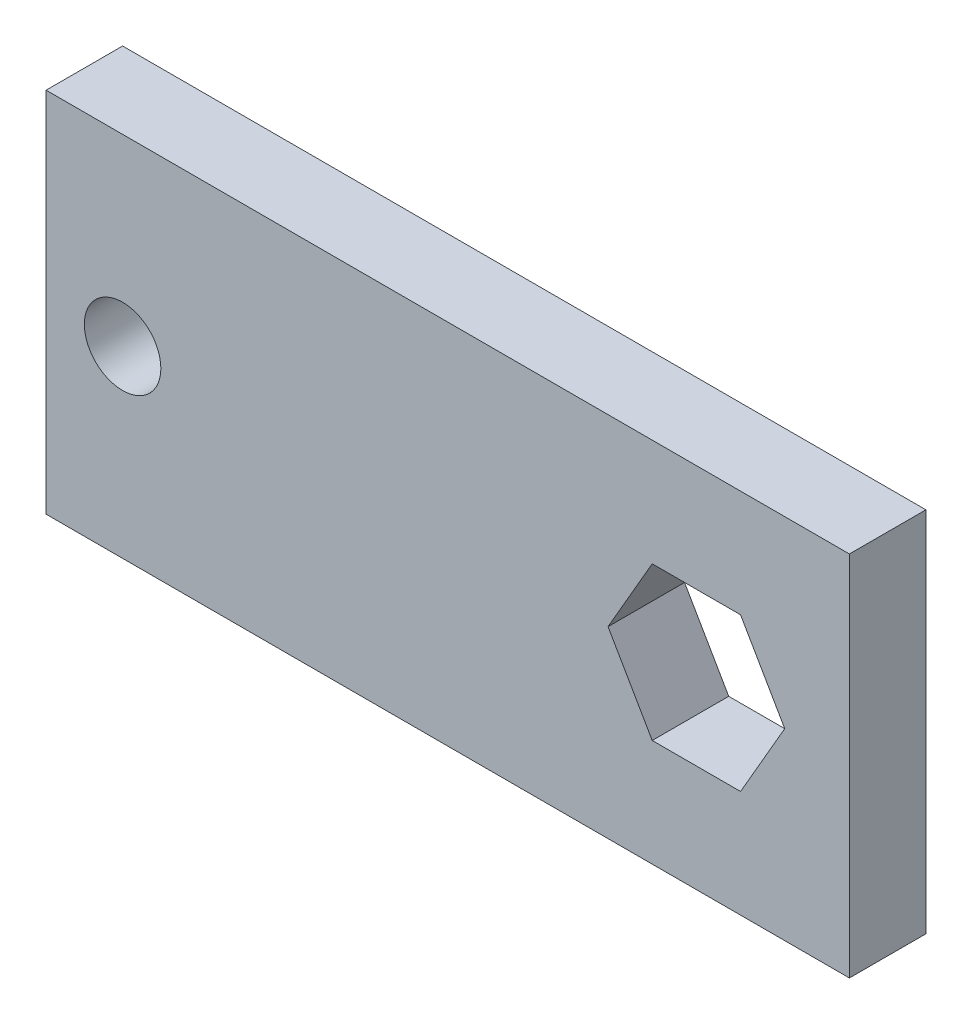
ISO-10303-21;
HEADER;
FILE_DESCRIPTION(('STEP AP214'),'2;1');
FILE_NAME('part.step','',(''),(''),'','','');
FILE_SCHEMA(('AUTOMOTIVE_DESIGN { 1 0 10303 214 1 1 1 1 }'));
ENDSEC;
DATA;
#1=APPLICATION_CONTEXT('core data for automotive mechanical design processes');
#2=APPLICATION_PROTOCOL_DEFINITION('international standard','automotive_design',2000,#1);
#3=PRODUCT_CONTEXT('',#1,'mechanical');
#4=PRODUCT('Part','Part','',(#3));
#5=PRODUCT_RELATED_PRODUCT_CATEGORY('part','',(#4));
#6=PRODUCT_DEFINITION_FORMATION('','',#4);
#7=PRODUCT_DEFINITION_CONTEXT('part definition',#1,'design');
#8=PRODUCT_DEFINITION('design','',#6,#7);
#9=PRODUCT_DEFINITION_SHAPE('','',#8);
#10=(LENGTH_UNIT() NAMED_UNIT(*) SI_UNIT(.MILLI.,.METRE.));
#11=(NAMED_UNIT(*) PLANE_ANGLE_UNIT() SI_UNIT($,.RADIAN.));
#12=(NAMED_UNIT(*) SI_UNIT($,.STERADIAN.) SOLID_ANGLE_UNIT());
#13=UNCERTAINTY_MEASURE_WITH_UNIT(LENGTH_MEASURE(1.E-05),#10,'distance_accuracy_value','');
#14=(GEOMETRIC_REPRESENTATION_CONTEXT(3) GLOBAL_UNCERTAINTY_ASSIGNED_CONTEXT((#13)) GLOBAL_UNIT_ASSIGNED_CONTEXT((#10,
#11,#12)) REPRESENTATION_CONTEXT('',''));
#15=CARTESIAN_POINT('',(0.,0.,0.));
#16=DIRECTION('',(0.,0.,1.));
#17=DIRECTION('',(1.,0.,0.));
#18=AXIS2_PLACEMENT_3D('',#15,#16,#17);
#19=CARTESIAN_POINT('',(0.,15.24,6.35));
#20=DIRECTION('',(0.,-1.,0.));
#21=DIRECTION('',(1.,0.,0.));
#22=AXIS2_PLACEMENT_3D('',#19,#20,#21);
#23=PLANE('',#22);
#24=DIRECTION('',(-1.,0.,0.));
#25=VECTOR('',#24,1.);
#26=CARTESIAN_POINT('',(0.,15.24,0.));
#27=LINE('',#26,#25);
#28=CARTESIAN_POINT('',(12.7,15.24,0.));
#29=VERTEX_POINT('',#28);
#30=CARTESIAN_POINT('',(-53.975,15.24,0.));
#31=VERTEX_POINT('',#30);
#32=EDGE_CURVE('E168',#29,#31,#27,.T.);
#33=ORIENTED_EDGE('',*,*,#32,.T.);
#34=DIRECTION('',(0.,0.,-1.));
#35=VECTOR('',#34,1.);
#36=CARTESIAN_POINT('',(-53.975,15.24,6.35));
#37=LINE('',#36,#35);
#38=CARTESIAN_POINT('',(-53.975,15.24,6.35));
#39=VERTEX_POINT('',#38);
#40=EDGE_CURVE('E11',#39,#31,#37,.T.);
#41=ORIENTED_EDGE('',*,*,#40,.F.);
#42=DIRECTION('',(-1.,0.,0.));
#43=VECTOR('',#42,1.);
#44=CARTESIAN_POINT('',(0.,15.24,6.35));
#45=LINE('',#44,#43);
#46=CARTESIAN_POINT('',(12.7,15.24,6.35));
#47=VERTEX_POINT('',#46);
#48=EDGE_CURVE('E130',#47,#39,#45,.T.);
#49=ORIENTED_EDGE('',*,*,#48,.F.);
#50=DIRECTION('',(0.,0.,-1.));
#51=VECTOR('',#50,1.);
#52=CARTESIAN_POINT('',(12.7,15.24,6.35));
#53=LINE('',#52,#51);
#54=EDGE_CURVE('E58',#47,#29,#53,.T.);
#55=ORIENTED_EDGE('',*,*,#54,.T.);
#56=EDGE_LOOP('',(#33,#41,#49,#55));
#57=FACE_BOUND('',#56,.T.);
#58=ADVANCED_FACE('F39',(#57),#23,.F.);
#59=CARTESIAN_POINT('',(-53.975,0.,6.35));
#60=DIRECTION('',(1.,0.,0.));
#61=DIRECTION('',(0.,0.,-1.));
#62=AXIS2_PLACEMENT_3D('',#59,#60,#61);
#63=PLANE('',#62);
#64=DIRECTION('',(0.,-1.,0.));
#65=VECTOR('',#64,1.);
#66=CARTESIAN_POINT('',(-53.975,0.,0.));
#67=LINE('',#66,#65);
#68=CARTESIAN_POINT('',(-53.975,-15.24,0.));
#69=VERTEX_POINT('',#68);
#70=EDGE_CURVE('E136',#31,#69,#67,.T.);
#71=ORIENTED_EDGE('',*,*,#70,.T.);
#72=DIRECTION('',(0.,0.,-1.));
#73=VECTOR('',#72,1.);
#74=CARTESIAN_POINT('',(-53.975,-15.24,6.35));
#75=LINE('',#74,#73);
#76=CARTESIAN_POINT('',(-53.975,-15.24,6.35));
#77=VERTEX_POINT('',#76);
#78=EDGE_CURVE('E49',#77,#69,#75,.T.);
#79=ORIENTED_EDGE('',*,*,#78,.F.);
#80=DIRECTION('',(0.,-1.,0.));
#81=VECTOR('',#80,1.);
#82=CARTESIAN_POINT('',(-53.975,0.,6.35));
#83=LINE('',#82,#81);
#84=EDGE_CURVE('E124',#39,#77,#83,.T.);
#85=ORIENTED_EDGE('',*,*,#84,.F.);
#86=ORIENTED_EDGE('',*,*,#40,.T.);
#87=EDGE_LOOP('',(#71,#79,#85,#86));
#88=FACE_BOUND('',#87,.T.);
#89=ADVANCED_FACE('F135',(#88),#63,.F.);
#90=CARTESIAN_POINT('',(0.,-15.24,6.35));
#91=DIRECTION('',(0.,-1.,0.));
#92=DIRECTION('',(1.,0.,0.));
#93=AXIS2_PLACEMENT_3D('',#90,#91,#92);
#94=PLANE('',#93);
#95=DIRECTION('',(-1.,0.,0.));
#96=VECTOR('',#95,1.);
#97=CARTESIAN_POINT('',(0.,-15.24,0.));
#98=LINE('',#97,#96);
#99=CARTESIAN_POINT('',(12.7,-15.24,0.));
#100=VERTEX_POINT('',#99);
#101=EDGE_CURVE('E171',#100,#69,#98,.T.);
#102=ORIENTED_EDGE('',*,*,#101,.F.);
#103=DIRECTION('',(0.,0.,-1.));
#104=VECTOR('',#103,1.);
#105=CARTESIAN_POINT('',(12.7,-15.24,6.35));
#106=LINE('',#105,#104);
#107=CARTESIAN_POINT('',(12.7,-15.24,6.35));
#108=VERTEX_POINT('',#107);
#109=EDGE_CURVE('E90',#108,#100,#106,.T.);
#110=ORIENTED_EDGE('',*,*,#109,.F.);
#111=DIRECTION('',(-1.,0.,0.));
#112=VECTOR('',#111,1.);
#113=CARTESIAN_POINT('',(0.,-15.24,6.35));
#114=LINE('',#113,#112);
#115=EDGE_CURVE('E129',#108,#77,#114,.T.);
#116=ORIENTED_EDGE('',*,*,#115,.T.);
#117=ORIENTED_EDGE('',*,*,#78,.T.);
#118=EDGE_LOOP('',(#102,#110,#116,#117));
#119=FACE_BOUND('',#118,.T.);
#120=ADVANCED_FACE('F140',(#119),#94,.T.);
#121=CARTESIAN_POINT('',(5.49926131403119,3.175,6.35));
#122=DIRECTION('',(-0.866025403784438,-0.5,0.));
#123=DIRECTION('',(0.5,-0.866025403784438,0.));
#124=AXIS2_PLACEMENT_3D('',#121,#122,#123);
#125=PLANE('',#124);
#126=DIRECTION('',(-0.5,0.866025403784438,0.));
#127=VECTOR('',#126,1.);
#128=CARTESIAN_POINT('',(5.49926131403119,3.175,0.));
#129=LINE('',#128,#127);
#130=CARTESIAN_POINT('',(7.33234841870825,0.,0.));
#131=VERTEX_POINT('',#130);
#132=CARTESIAN_POINT('',(3.66617420935412,6.35,0.));
#133=VERTEX_POINT('',#132);
#134=EDGE_CURVE('E150',#131,#133,#129,.T.);
#135=ORIENTED_EDGE('',*,*,#134,.F.);
#136=DIRECTION('',(0.,0.,-1.));
#137=VECTOR('',#136,1.);
#138=CARTESIAN_POINT('',(7.33234841870825,0.,6.35));
#139=LINE('',#138,#137);
#140=CARTESIAN_POINT('',(7.33234841870825,0.,6.35));
#141=VERTEX_POINT('',#140);
#142=EDGE_CURVE('E43',#141,#131,#139,.T.);
#143=ORIENTED_EDGE('',*,*,#142,.F.);
#144=DIRECTION('',(-0.5,0.866025403784438,0.));
#145=VECTOR('',#144,1.);
#146=CARTESIAN_POINT('',(5.49926131403119,3.175,6.35));
#147=LINE('',#146,#145);
#148=CARTESIAN_POINT('',(3.66617420935412,6.35,6.35));
#149=VERTEX_POINT('',#148);
#150=EDGE_CURVE('E224',#141,#149,#147,.T.);
#151=ORIENTED_EDGE('',*,*,#150,.T.);
#152=DIRECTION('',(0.,0.,-1.));
#153=VECTOR('',#152,1.);
#154=CARTESIAN_POINT('',(3.66617420935412,6.35,6.35));
#155=LINE('',#154,#153);
#156=EDGE_CURVE('E143',#149,#133,#155,.T.);
#157=ORIENTED_EDGE('',*,*,#156,.T.);
#158=EDGE_LOOP('',(#135,#143,#151,#157));
#159=FACE_BOUND('',#158,.T.);
#160=ADVANCED_FACE('F195',(#159),#125,.T.);
#161=CARTESIAN_POINT('',(5.49926131403119,-3.175,6.35));
#162=DIRECTION('',(-0.866025403784439,0.5,0.));
#163=DIRECTION('',(-0.5,-0.866025403784439,0.));
#164=AXIS2_PLACEMENT_3D('',#161,#162,#163);
#165=PLANE('',#164);
#166=DIRECTION('',(0.5,0.866025403784439,0.));
#167=VECTOR('',#166,1.);
#168=CARTESIAN_POINT('',(5.49926131403119,-3.175,0.));
#169=LINE('',#168,#167);
#170=CARTESIAN_POINT('',(3.66617420935413,-6.35,0.));
#171=VERTEX_POINT('',#170);
#172=EDGE_CURVE('E153',#171,#131,#169,.T.);
#173=ORIENTED_EDGE('',*,*,#172,.F.);
#174=DIRECTION('',(0.,0.,-1.));
#175=VECTOR('',#174,1.);
#176=CARTESIAN_POINT('',(3.66617420935413,-6.35,6.35));
#177=LINE('',#176,#175);
#178=CARTESIAN_POINT('',(3.66617420935413,-6.35,6.35));
#179=VERTEX_POINT('',#178);
#180=EDGE_CURVE('E185',#179,#171,#177,.T.);
#181=ORIENTED_EDGE('',*,*,#180,.F.);
#182=DIRECTION('',(0.5,0.866025403784439,0.));
#183=VECTOR('',#182,1.);
#184=CARTESIAN_POINT('',(5.49926131403119,-3.175,6.35));
#185=LINE('',#184,#183);
#186=EDGE_CURVE('E194',#179,#141,#185,.T.);
#187=ORIENTED_EDGE('',*,*,#186,.T.);
#188=ORIENTED_EDGE('',*,*,#142,.T.);
#189=EDGE_LOOP('',(#173,#181,#187,#188));
#190=FACE_BOUND('',#189,.T.);
#191=ADVANCED_FACE('F192',(#190),#165,.T.);
#192=CARTESIAN_POINT('',(0.,-6.35,6.35));
#193=DIRECTION('',(0.,1.,0.));
#194=DIRECTION('',(-1.,0.,0.));
#195=AXIS2_PLACEMENT_3D('',#192,#193,#194);
#196=PLANE('',#195);
#197=DIRECTION('',(1.,0.,0.));
#198=VECTOR('',#197,1.);
#199=CARTESIAN_POINT('',(0.,-6.35,0.));
#200=LINE('',#199,#198);
#201=CARTESIAN_POINT('',(-3.66617420935412,-6.35,0.));
#202=VERTEX_POINT('',#201);
#203=EDGE_CURVE('E156',#202,#171,#200,.T.);
#204=ORIENTED_EDGE('',*,*,#203,.F.);
#205=DIRECTION('',(0.,0.,-1.));
#206=VECTOR('',#205,1.);
#207=CARTESIAN_POINT('',(-3.66617420935412,-6.35,6.35));
#208=LINE('',#207,#206);
#209=CARTESIAN_POINT('',(-3.66617420935412,-6.35,6.35));
#210=VERTEX_POINT('',#209);
#211=EDGE_CURVE('E184',#210,#202,#208,.T.);
#212=ORIENTED_EDGE('',*,*,#211,.F.);
#213=DIRECTION('',(1.,0.,0.));
#214=VECTOR('',#213,1.);
#215=CARTESIAN_POINT('',(0.,-6.35,6.35));
#216=LINE('',#215,#214);
#217=EDGE_CURVE('E203',#210,#179,#216,.T.);
#218=ORIENTED_EDGE('',*,*,#217,.T.);
#219=ORIENTED_EDGE('',*,*,#180,.T.);
#220=EDGE_LOOP('',(#204,#212,#218,#219));
#221=FACE_BOUND('',#220,.T.);
#222=ADVANCED_FACE('F201',(#221),#196,.T.);
#223=CARTESIAN_POINT('',(-5.49926131403118,-3.175,6.35));
#224=DIRECTION('',(0.866025403784438,0.5,0.));
#225=DIRECTION('',(-0.5,0.866025403784438,0.));
#226=AXIS2_PLACEMENT_3D('',#223,#224,#225);
#227=PLANE('',#226);
#228=DIRECTION('',(0.5,-0.866025403784438,0.));
#229=VECTOR('',#228,1.);
#230=CARTESIAN_POINT('',(-5.49926131403118,-3.175,0.));
#231=LINE('',#230,#229);
#232=CARTESIAN_POINT('',(-7.33234841870825,0.,0.));
#233=VERTEX_POINT('',#232);
#234=EDGE_CURVE('E159',#233,#202,#231,.T.);
#235=ORIENTED_EDGE('',*,*,#234,.F.);
#236=DIRECTION('',(0.,0.,-1.));
#237=VECTOR('',#236,1.);
#238=CARTESIAN_POINT('',(-7.33234841870825,0.,6.35));
#239=LINE('',#238,#237);
#240=CARTESIAN_POINT('',(-7.33234841870825,0.,6.35));
#241=VERTEX_POINT('',#240);
#242=EDGE_CURVE('E182',#241,#233,#239,.T.);
#243=ORIENTED_EDGE('',*,*,#242,.F.);
#244=DIRECTION('',(0.5,-0.866025403784438,0.));
#245=VECTOR('',#244,1.);
#246=CARTESIAN_POINT('',(-5.49926131403118,-3.175,6.35));
#247=LINE('',#246,#245);
#248=EDGE_CURVE('E209',#241,#210,#247,.T.);
#249=ORIENTED_EDGE('',*,*,#248,.T.);
#250=ORIENTED_EDGE('',*,*,#211,.T.);
#251=EDGE_LOOP('',(#235,#243,#249,#250));
#252=FACE_BOUND('',#251,.T.);
#253=ADVANCED_FACE('F212',(#252),#227,.T.);
#254=CARTESIAN_POINT('',(-5.49926131403119,3.175,6.35));
#255=DIRECTION('',(0.866025403784439,-0.5,0.));
#256=DIRECTION('',(0.5,0.866025403784439,0.));
#257=AXIS2_PLACEMENT_3D('',#254,#255,#256);
#258=PLANE('',#257);
#259=DIRECTION('',(-0.5,-0.866025403784439,0.));
#260=VECTOR('',#259,1.);
#261=CARTESIAN_POINT('',(-5.49926131403119,3.175,0.));
#262=LINE('',#261,#260);
#263=CARTESIAN_POINT('',(-3.66617420935413,6.35,0.));
#264=VERTEX_POINT('',#263);
#265=EDGE_CURVE('E162',#264,#233,#262,.T.);
#266=ORIENTED_EDGE('',*,*,#265,.F.);
#267=DIRECTION('',(0.,0.,-1.));
#268=VECTOR('',#267,1.);
#269=CARTESIAN_POINT('',(-3.66617420935413,6.35,6.35));
#270=LINE('',#269,#268);
#271=CARTESIAN_POINT('',(-3.66617420935413,6.35,6.35));
#272=VERTEX_POINT('',#271);
#273=EDGE_CURVE('E180',#272,#264,#270,.T.);
#274=ORIENTED_EDGE('',*,*,#273,.F.);
#275=DIRECTION('',(-0.5,-0.866025403784439,0.));
#276=VECTOR('',#275,1.);
#277=CARTESIAN_POINT('',(-5.49926131403119,3.175,6.35));
#278=LINE('',#277,#276);
#279=EDGE_CURVE('E213',#272,#241,#278,.T.);
#280=ORIENTED_EDGE('',*,*,#279,.T.);
#281=ORIENTED_EDGE('',*,*,#242,.T.);
#282=EDGE_LOOP('',(#266,#274,#280,#281));
#283=FACE_BOUND('',#282,.T.);
#284=ADVANCED_FACE('F226',(#283),#258,.T.);
#285=CARTESIAN_POINT('',(0.,6.35,6.35));
#286=DIRECTION('',(0.,-1.,0.));
#287=DIRECTION('',(1.,0.,0.));
#288=AXIS2_PLACEMENT_3D('',#285,#286,#287);
#289=PLANE('',#288);
#290=DIRECTION('',(-1.,0.,0.));
#291=VECTOR('',#290,1.);
#292=CARTESIAN_POINT('',(0.,6.35,0.));
#293=LINE('',#292,#291);
#294=EDGE_CURVE('E165',#133,#264,#293,.T.);
#295=ORIENTED_EDGE('',*,*,#294,.F.);
#296=ORIENTED_EDGE('',*,*,#156,.F.);
#297=DIRECTION('',(-1.,0.,0.));
#298=VECTOR('',#297,1.);
#299=CARTESIAN_POINT('',(0.,6.35,6.35));
#300=LINE('',#299,#298);
#301=EDGE_CURVE('E215',#149,#272,#300,.T.);
#302=ORIENTED_EDGE('',*,*,#301,.T.);
#303=ORIENTED_EDGE('',*,*,#273,.T.);
#304=EDGE_LOOP('',(#295,#296,#302,#303));
#305=FACE_BOUND('',#304,.T.);
#306=ADVANCED_FACE('F222',(#305),#289,.T.);
#307=CARTESIAN_POINT('',(-47.625,0.,6.35));
#308=DIRECTION('',(0.,0.,-1.));
#309=DIRECTION('',(-1.,0.,0.));
#310=AXIS2_PLACEMENT_3D('',#307,#308,#309);
#311=CYLINDRICAL_SURFACE('',#310,3.17500000000001);
#312=CARTESIAN_POINT('',(-47.625,0.,6.35));
#313=DIRECTION('',(0.,0.,1.));
#314=DIRECTION('',(1.,0.,0.));
#315=AXIS2_PLACEMENT_3D('',#312,#313,#314);
#316=CIRCLE('',#315,3.17500000000001);
#317=CARTESIAN_POINT('',(-44.45,0.,6.35));
#318=VERTEX_POINT('',#317);
#319=EDGE_CURVE('E176',#318,#318,#316,.T.);
#320=ORIENTED_EDGE('',*,*,#319,.T.);
#321=EDGE_LOOP('',(#320));
#322=FACE_BOUND('',#321,.T.);
#323=CARTESIAN_POINT('',(-47.625,0.,0.));
#324=DIRECTION('',(0.,0.,1.));
#325=DIRECTION('',(1.,0.,0.));
#326=AXIS2_PLACEMENT_3D('',#323,#324,#325);
#327=CIRCLE('',#326,3.17500000000001);
#328=CARTESIAN_POINT('',(-44.45,0.,0.));
#329=VERTEX_POINT('',#328);
#330=EDGE_CURVE('E147',#329,#329,#327,.T.);
#331=ORIENTED_EDGE('',*,*,#330,.F.);
#332=EDGE_LOOP('',(#331));
#333=FACE_BOUND('',#332,.T.);
#334=ADVANCED_FACE('F41',(#322,#333),#311,.F.);
#335=CARTESIAN_POINT('',(12.7,0.,6.35));
#336=DIRECTION('',(1.,0.,0.));
#337=DIRECTION('',(0.,0.,-1.));
#338=AXIS2_PLACEMENT_3D('',#335,#336,#337);
#339=PLANE('',#338);
#340=DIRECTION('',(0.,-1.,0.));
#341=VECTOR('',#340,1.);
#342=CARTESIAN_POINT('',(12.7,0.,0.));
#343=LINE('',#342,#341);
#344=EDGE_CURVE('E173',#29,#100,#343,.T.);
#345=ORIENTED_EDGE('',*,*,#344,.F.);
#346=ORIENTED_EDGE('',*,*,#54,.F.);
#347=DIRECTION('',(0.,-1.,0.));
#348=VECTOR('',#347,1.);
#349=CARTESIAN_POINT('',(12.7,0.,6.35));
#350=LINE('',#349,#348);
#351=EDGE_CURVE('E141',#47,#108,#350,.T.);
#352=ORIENTED_EDGE('',*,*,#351,.T.);
#353=ORIENTED_EDGE('',*,*,#109,.T.);
#354=EDGE_LOOP('',(#345,#346,#352,#353));
#355=FACE_BOUND('',#354,.T.);
#356=ADVANCED_FACE('F244',(#355),#339,.T.);
#357=CARTESIAN_POINT('',(0.,0.,6.35));
#358=DIRECTION('',(0.,0.,1.));
#359=DIRECTION('',(1.,0.,0.));
#360=AXIS2_PLACEMENT_3D('',#357,#358,#359);
#361=PLANE('',#360);
#362=ORIENTED_EDGE('',*,*,#319,.F.);
#363=EDGE_LOOP('',(#362));
#364=FACE_BOUND('',#363,.T.);
#365=ORIENTED_EDGE('',*,*,#150,.F.);
#366=ORIENTED_EDGE('',*,*,#186,.F.);
#367=ORIENTED_EDGE('',*,*,#217,.F.);
#368=ORIENTED_EDGE('',*,*,#248,.F.);
#369=ORIENTED_EDGE('',*,*,#279,.F.);
#370=ORIENTED_EDGE('',*,*,#301,.F.);
#371=EDGE_LOOP('',(#365,#366,#367,#368,#369,#370));
#372=FACE_BOUND('',#371,.T.);
#373=ORIENTED_EDGE('',*,*,#48,.T.);
#374=ORIENTED_EDGE('',*,*,#84,.T.);
#375=ORIENTED_EDGE('',*,*,#115,.F.);
#376=ORIENTED_EDGE('',*,*,#351,.F.);
#377=EDGE_LOOP('',(#373,#374,#375,#376));
#378=FACE_BOUND('',#377,.T.);
#379=ADVANCED_FACE('F126',(#364,#372,#378),#361,.T.);
#380=CARTESIAN_POINT('',(0.,0.,0.));
#381=DIRECTION('',(0.,0.,1.));
#382=DIRECTION('',(1.,0.,0.));
#383=AXIS2_PLACEMENT_3D('',#380,#381,#382);
#384=PLANE('',#383);
#385=ORIENTED_EDGE('',*,*,#330,.T.);
#386=EDGE_LOOP('',(#385));
#387=FACE_BOUND('',#386,.T.);
#388=ORIENTED_EDGE('',*,*,#134,.T.);
#389=ORIENTED_EDGE('',*,*,#294,.T.);
#390=ORIENTED_EDGE('',*,*,#265,.T.);
#391=ORIENTED_EDGE('',*,*,#234,.T.);
#392=ORIENTED_EDGE('',*,*,#203,.T.);
#393=ORIENTED_EDGE('',*,*,#172,.T.);
#394=EDGE_LOOP('',(#388,#389,#390,#391,#392,#393));
#395=FACE_BOUND('',#394,.T.);
#396=ORIENTED_EDGE('',*,*,#32,.F.);
#397=ORIENTED_EDGE('',*,*,#344,.T.);
#398=ORIENTED_EDGE('',*,*,#101,.T.);
#399=ORIENTED_EDGE('',*,*,#70,.F.);
#400=EDGE_LOOP('',(#396,#397,#398,#399));
#401=FACE_BOUND('',#400,.T.);
#402=ADVANCED_FACE('F198',(#387,#395,#401),#384,.F.);
#403=CLOSED_SHELL('',(#58,#89,#120,#160,#191,#222,#253,#284,#306,#334,#356,#379,#402));
#404=MANIFOLD_SOLID_BREP('B2',#403);
#405=ADVANCED_BREP_SHAPE_REPRESENTATION('',(#18,#404),#14);
#406=SHAPE_DEFINITION_REPRESENTATION(#9,#405);
ENDSEC;
END-ISO-10303-21;
